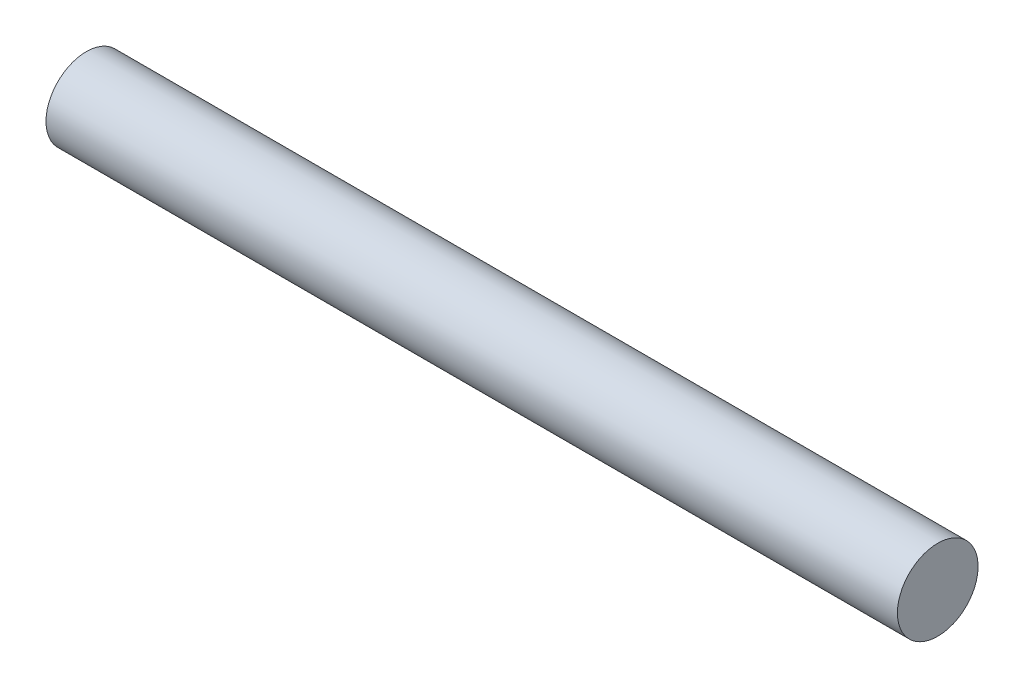
ISO-10303-21;
HEADER;
FILE_DESCRIPTION(('STEP AP214'),'2;1');
FILE_NAME('part.step','',(''),(''),'','','');
FILE_SCHEMA(('AUTOMOTIVE_DESIGN { 1 0 10303 214 1 1 1 1 }'));
ENDSEC;
DATA;
#1=APPLICATION_CONTEXT('core data for automotive mechanical design processes');
#2=APPLICATION_PROTOCOL_DEFINITION('international standard','automotive_design',2000,#1);
#3=PRODUCT_CONTEXT('',#1,'mechanical');
#4=PRODUCT('Part','Part','',(#3));
#5=PRODUCT_RELATED_PRODUCT_CATEGORY('part','',(#4));
#6=PRODUCT_DEFINITION_FORMATION('','',#4);
#7=PRODUCT_DEFINITION_CONTEXT('part definition',#1,'design');
#8=PRODUCT_DEFINITION('design','',#6,#7);
#9=PRODUCT_DEFINITION_SHAPE('','',#8);
#10=(LENGTH_UNIT() NAMED_UNIT(*) SI_UNIT(.MILLI.,.METRE.));
#11=(NAMED_UNIT(*) PLANE_ANGLE_UNIT() SI_UNIT($,.RADIAN.));
#12=(NAMED_UNIT(*) SI_UNIT($,.STERADIAN.) SOLID_ANGLE_UNIT());
#13=UNCERTAINTY_MEASURE_WITH_UNIT(LENGTH_MEASURE(1.E-05),#10,'distance_accuracy_value','');
#14=(GEOMETRIC_REPRESENTATION_CONTEXT(3) GLOBAL_UNCERTAINTY_ASSIGNED_CONTEXT((#13)) GLOBAL_UNIT_ASSIGNED_CONTEXT((#10,
#11,#12)) REPRESENTATION_CONTEXT('',''));
#15=CARTESIAN_POINT('',(0.,0.,0.));
#16=DIRECTION('',(0.,0.,1.));
#17=DIRECTION('',(1.,0.,0.));
#18=AXIS2_PLACEMENT_3D('',#15,#16,#17);
#19=CARTESIAN_POINT('',(20.4124476619881,0.,0.));
#20=DIRECTION('',(-1.,0.,0.));
#21=DIRECTION('',(0.,0.,1.));
#22=AXIS2_PLACEMENT_3D('',#19,#20,#21);
#23=PLANE('',#22);
#24=CARTESIAN_POINT('',(20.4124476619881,451.999785752155,0.));
#25=DIRECTION('',(-1.,0.,0.));
#26=DIRECTION('',(0.,0.,1.));
#27=AXIS2_PLACEMENT_3D('',#24,#25,#26);
#28=CIRCLE('',#27,9.00000000000001);
#29=CARTESIAN_POINT('',(20.4124476619881,451.999785752155,9.00000000000001));
#30=VERTEX_POINT('',#29);
#31=EDGE_CURVE('E10',#30,#30,#28,.T.);
#32=ORIENTED_EDGE('',*,*,#31,.F.);
#33=EDGE_LOOP('',(#32));
#34=FACE_BOUND('',#33,.T.);
#35=ADVANCED_FACE('F35',(#34),#23,.F.);
#36=CARTESIAN_POINT('',(-169.636319647738,451.999785752155,0.));
#37=DIRECTION('',(-1.,0.,0.));
#38=DIRECTION('',(0.,0.,1.));
#39=AXIS2_PLACEMENT_3D('',#36,#37,#38);
#40=CYLINDRICAL_SURFACE('',#39,9.00000000000001);
#41=ORIENTED_EDGE('',*,*,#31,.T.);
#42=EDGE_LOOP('',(#41));
#43=FACE_BOUND('',#42,.T.);
#44=CARTESIAN_POINT('',(-169.636319647738,451.999785752155,0.));
#45=DIRECTION('',(-1.,0.,0.));
#46=DIRECTION('',(0.,0.,1.));
#47=AXIS2_PLACEMENT_3D('',#44,#45,#46);
#48=CIRCLE('',#47,9.00000000000001);
#49=CARTESIAN_POINT('',(-169.636319647738,451.999785752155,9.00000000000001));
#50=VERTEX_POINT('',#49);
#51=EDGE_CURVE('E41',#50,#50,#48,.T.);
#52=ORIENTED_EDGE('',*,*,#51,.F.);
#53=EDGE_LOOP('',(#52));
#54=FACE_BOUND('',#53,.T.);
#55=ADVANCED_FACE('F49',(#43,#54),#40,.T.);
#56=CARTESIAN_POINT('',(-169.636319647738,0.,0.));
#57=DIRECTION('',(-1.,0.,0.));
#58=DIRECTION('',(0.,0.,1.));
#59=AXIS2_PLACEMENT_3D('',#56,#57,#58);
#60=PLANE('',#59);
#61=ORIENTED_EDGE('',*,*,#51,.T.);
#62=EDGE_LOOP('',(#61));
#63=FACE_BOUND('',#62,.T.);
#64=ADVANCED_FACE('F47',(#63),#60,.T.);
#65=CLOSED_SHELL('',(#35,#55,#64));
#66=MANIFOLD_SOLID_BREP('B2',#65);
#67=ADVANCED_BREP_SHAPE_REPRESENTATION('',(#18,#66),#14);
#68=SHAPE_DEFINITION_REPRESENTATION(#9,#67);
ENDSEC;
END-ISO-10303-21;
